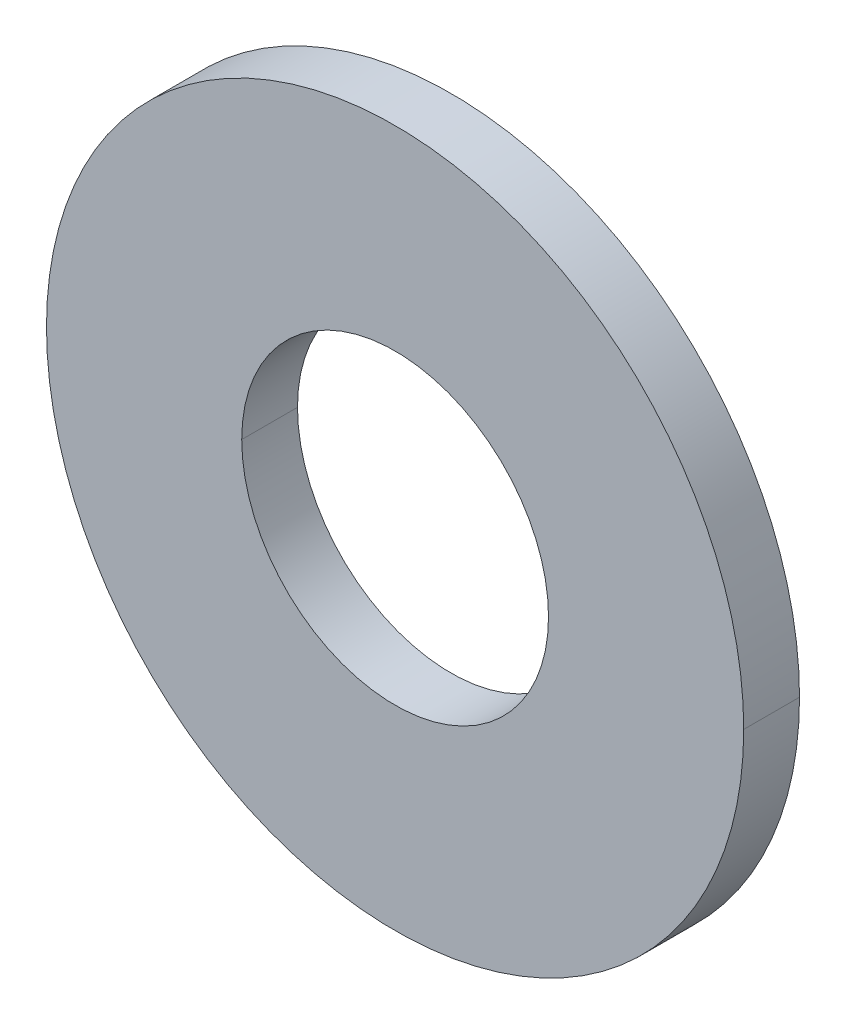
ISO-10303-21;
HEADER;
FILE_DESCRIPTION(('STEP AP214'),'2;1');
FILE_NAME('part.step','',(''),(''),'','','');
FILE_SCHEMA(('AUTOMOTIVE_DESIGN { 1 0 10303 214 1 1 1 1 }'));
ENDSEC;
DATA;
#1=APPLICATION_CONTEXT('core data for automotive mechanical design processes');
#2=APPLICATION_PROTOCOL_DEFINITION('international standard','automotive_design',2000,#1);
#3=PRODUCT_CONTEXT('',#1,'mechanical');
#4=PRODUCT('Part','Part','',(#3));
#5=PRODUCT_RELATED_PRODUCT_CATEGORY('part','',(#4));
#6=PRODUCT_DEFINITION_FORMATION('','',#4);
#7=PRODUCT_DEFINITION_CONTEXT('part definition',#1,'design');
#8=PRODUCT_DEFINITION('design','',#6,#7);
#9=PRODUCT_DEFINITION_SHAPE('','',#8);
#10=(LENGTH_UNIT() NAMED_UNIT(*) SI_UNIT(.MILLI.,.METRE.));
#11=(NAMED_UNIT(*) PLANE_ANGLE_UNIT() SI_UNIT($,.RADIAN.));
#12=(NAMED_UNIT(*) SI_UNIT($,.STERADIAN.) SOLID_ANGLE_UNIT());
#13=UNCERTAINTY_MEASURE_WITH_UNIT(LENGTH_MEASURE(1.E-05),#10,'distance_accuracy_value','');
#14=(GEOMETRIC_REPRESENTATION_CONTEXT(3) GLOBAL_UNCERTAINTY_ASSIGNED_CONTEXT((#13)) GLOBAL_UNIT_ASSIGNED_CONTEXT((#10,
#11,#12)) REPRESENTATION_CONTEXT('',''));
#15=CARTESIAN_POINT('',(0.,0.,0.));
#16=DIRECTION('',(0.,0.,1.));
#17=DIRECTION('',(1.,0.,0.));
#18=AXIS2_PLACEMENT_3D('',#15,#16,#17);
#19=CARTESIAN_POINT('',(0.,0.,0.4));
#20=DIRECTION('',(0.,0.,1.));
#21=DIRECTION('',(-1.,0.,0.));
#22=AXIS2_PLACEMENT_3D('',#19,#20,#21);
#23=CYLINDRICAL_SURFACE('',#22,1.1);
#24=DIRECTION('',(0.,0.,1.));
#25=VECTOR('',#24,1.);
#26=CARTESIAN_POINT('',(1.1,0.,0.));
#27=LINE('',#26,#25);
#28=CARTESIAN_POINT('',(1.1,0.,0.));
#29=VERTEX_POINT('',#28);
#30=CARTESIAN_POINT('',(1.1,0.,0.4));
#31=VERTEX_POINT('',#30);
#32=EDGE_CURVE('E35',#29,#31,#27,.T.);
#33=ORIENTED_EDGE('',*,*,#32,.F.);
#34=CARTESIAN_POINT('',(0.,0.,0.));
#35=DIRECTION('',(0.,0.,-1.));
#36=DIRECTION('',(1.,0.,0.));
#37=AXIS2_PLACEMENT_3D('',#34,#35,#36);
#38=CIRCLE('',#37,1.1);
#39=CARTESIAN_POINT('',(-1.1,0.,0.));
#40=VERTEX_POINT('',#39);
#41=EDGE_CURVE('E10',#29,#40,#38,.T.);
#42=ORIENTED_EDGE('',*,*,#41,.T.);
#43=DIRECTION('',(0.,0.,1.));
#44=VECTOR('',#43,1.);
#45=CARTESIAN_POINT('',(-1.1,0.,0.));
#46=LINE('',#45,#44);
#47=CARTESIAN_POINT('',(-1.1,0.,0.4));
#48=VERTEX_POINT('',#47);
#49=EDGE_CURVE('E27',#40,#48,#46,.T.);
#50=ORIENTED_EDGE('',*,*,#49,.T.);
#51=CARTESIAN_POINT('',(0.,0.,0.4));
#52=DIRECTION('',(0.,0.,-1.));
#53=DIRECTION('',(1.,0.,0.));
#54=AXIS2_PLACEMENT_3D('',#51,#52,#53);
#55=CIRCLE('',#54,1.1);
#56=EDGE_CURVE('E47',#31,#48,#55,.T.);
#57=ORIENTED_EDGE('',*,*,#56,.F.);
#58=EDGE_LOOP('',(#33,#42,#50,#57));
#59=FACE_BOUND('',#58,.T.);
#60=ADVANCED_FACE('F16',(#59),#23,.F.);
#61=CARTESIAN_POINT('',(0.,0.,0.4));
#62=DIRECTION('',(0.,0.,1.));
#63=DIRECTION('',(-1.,0.,0.));
#64=AXIS2_PLACEMENT_3D('',#61,#62,#63);
#65=CYLINDRICAL_SURFACE('',#64,1.1);
#66=CARTESIAN_POINT('',(0.,0.,0.4));
#67=DIRECTION('',(0.,0.,-1.));
#68=DIRECTION('',(-1.,0.,0.));
#69=AXIS2_PLACEMENT_3D('',#66,#67,#68);
#70=CIRCLE('',#69,1.1);
#71=EDGE_CURVE('E88',#48,#31,#70,.T.);
#72=ORIENTED_EDGE('',*,*,#71,.F.);
#73=ORIENTED_EDGE('',*,*,#49,.F.);
#74=CARTESIAN_POINT('',(0.,0.,0.));
#75=DIRECTION('',(0.,0.,-1.));
#76=DIRECTION('',(-1.,0.,0.));
#77=AXIS2_PLACEMENT_3D('',#74,#75,#76);
#78=CIRCLE('',#77,1.1);
#79=EDGE_CURVE('E90',#40,#29,#78,.T.);
#80=ORIENTED_EDGE('',*,*,#79,.T.);
#81=ORIENTED_EDGE('',*,*,#32,.T.);
#82=EDGE_LOOP('',(#72,#73,#80,#81));
#83=FACE_BOUND('',#82,.T.);
#84=ADVANCED_FACE('F18',(#83),#65,.F.);
#85=CARTESIAN_POINT('',(0.,0.,0.));
#86=DIRECTION('',(0.,0.,1.));
#87=DIRECTION('',(1.,0.,0.));
#88=AXIS2_PLACEMENT_3D('',#85,#86,#87);
#89=PLANE('',#88);
#90=ORIENTED_EDGE('',*,*,#79,.F.);
#91=ORIENTED_EDGE('',*,*,#41,.F.);
#92=EDGE_LOOP('',(#90,#91));
#93=FACE_BOUND('',#92,.T.);
#94=CARTESIAN_POINT('',(0.,0.,0.));
#95=DIRECTION('',(0.,0.,-1.));
#96=DIRECTION('',(-1.,0.,0.));
#97=AXIS2_PLACEMENT_3D('',#94,#95,#96);
#98=CIRCLE('',#97,2.5);
#99=CARTESIAN_POINT('',(-2.5,0.,0.));
#100=VERTEX_POINT('',#99);
#101=CARTESIAN_POINT('',(2.5,0.,0.));
#102=VERTEX_POINT('',#101);
#103=EDGE_CURVE('E85',#100,#102,#98,.T.);
#104=ORIENTED_EDGE('',*,*,#103,.T.);
#105=CARTESIAN_POINT('',(0.,0.,0.));
#106=DIRECTION('',(0.,0.,-1.));
#107=DIRECTION('',(1.,0.,0.));
#108=AXIS2_PLACEMENT_3D('',#105,#106,#107);
#109=CIRCLE('',#108,2.5);
#110=EDGE_CURVE('E76',#102,#100,#109,.T.);
#111=ORIENTED_EDGE('',*,*,#110,.T.);
#112=EDGE_LOOP('',(#104,#111));
#113=FACE_BOUND('',#112,.T.);
#114=ADVANCED_FACE('F129',(#93,#113),#89,.F.);
#115=CARTESIAN_POINT('',(0.,0.,0.4));
#116=DIRECTION('',(0.,0.,1.));
#117=DIRECTION('',(1.,0.,0.));
#118=AXIS2_PLACEMENT_3D('',#115,#116,#117);
#119=PLANE('',#118);
#120=ORIENTED_EDGE('',*,*,#71,.T.);
#121=ORIENTED_EDGE('',*,*,#56,.T.);
#122=EDGE_LOOP('',(#120,#121));
#123=FACE_BOUND('',#122,.T.);
#124=CARTESIAN_POINT('',(0.,0.,0.4));
#125=DIRECTION('',(0.,0.,-1.));
#126=DIRECTION('',(-1.,0.,0.));
#127=AXIS2_PLACEMENT_3D('',#124,#125,#126);
#128=CIRCLE('',#127,2.5);
#129=CARTESIAN_POINT('',(-2.5,0.,0.4));
#130=VERTEX_POINT('',#129);
#131=CARTESIAN_POINT('',(2.5,0.,0.4));
#132=VERTEX_POINT('',#131);
#133=EDGE_CURVE('E60',#130,#132,#128,.T.);
#134=ORIENTED_EDGE('',*,*,#133,.F.);
#135=CARTESIAN_POINT('',(0.,0.,0.4));
#136=DIRECTION('',(0.,0.,-1.));
#137=DIRECTION('',(1.,0.,0.));
#138=AXIS2_PLACEMENT_3D('',#135,#136,#137);
#139=CIRCLE('',#138,2.5);
#140=EDGE_CURVE('E20',#132,#130,#139,.T.);
#141=ORIENTED_EDGE('',*,*,#140,.F.);
#142=EDGE_LOOP('',(#134,#141));
#143=FACE_BOUND('',#142,.T.);
#144=ADVANCED_FACE('F59',(#123,#143),#119,.T.);
#145=CARTESIAN_POINT('',(0.,0.,0.4));
#146=DIRECTION('',(0.,0.,1.));
#147=DIRECTION('',(-1.,0.,0.));
#148=AXIS2_PLACEMENT_3D('',#145,#146,#147);
#149=CYLINDRICAL_SURFACE('',#148,2.5);
#150=DIRECTION('',(0.,0.,1.));
#151=VECTOR('',#150,1.);
#152=CARTESIAN_POINT('',(2.5,0.,0.));
#153=LINE('',#152,#151);
#154=EDGE_CURVE('E66',#102,#132,#153,.T.);
#155=ORIENTED_EDGE('',*,*,#154,.F.);
#156=ORIENTED_EDGE('',*,*,#103,.F.);
#157=DIRECTION('',(0.,0.,1.));
#158=VECTOR('',#157,1.);
#159=CARTESIAN_POINT('',(-2.5,0.,0.));
#160=LINE('',#159,#158);
#161=EDGE_CURVE('E71',#100,#130,#160,.T.);
#162=ORIENTED_EDGE('',*,*,#161,.T.);
#163=ORIENTED_EDGE('',*,*,#133,.T.);
#164=EDGE_LOOP('',(#155,#156,#162,#163));
#165=FACE_BOUND('',#164,.T.);
#166=ADVANCED_FACE('F69',(#165),#149,.T.);
#167=CARTESIAN_POINT('',(0.,0.,0.4));
#168=DIRECTION('',(0.,0.,1.));
#169=DIRECTION('',(-1.,0.,0.));
#170=AXIS2_PLACEMENT_3D('',#167,#168,#169);
#171=CYLINDRICAL_SURFACE('',#170,2.5);
#172=ORIENTED_EDGE('',*,*,#140,.T.);
#173=ORIENTED_EDGE('',*,*,#161,.F.);
#174=ORIENTED_EDGE('',*,*,#110,.F.);
#175=ORIENTED_EDGE('',*,*,#154,.T.);
#176=EDGE_LOOP('',(#172,#173,#174,#175));
#177=FACE_BOUND('',#176,.T.);
#178=ADVANCED_FACE('F74',(#177),#171,.T.);
#179=CLOSED_SHELL('',(#60,#84,#114,#144,#166,#178));
#180=MANIFOLD_SOLID_BREP('B1',#179);
#181=ADVANCED_BREP_SHAPE_REPRESENTATION('',(#18,#180),#14);
#182=SHAPE_DEFINITION_REPRESENTATION(#9,#181);
ENDSEC;
END-ISO-10303-21;
